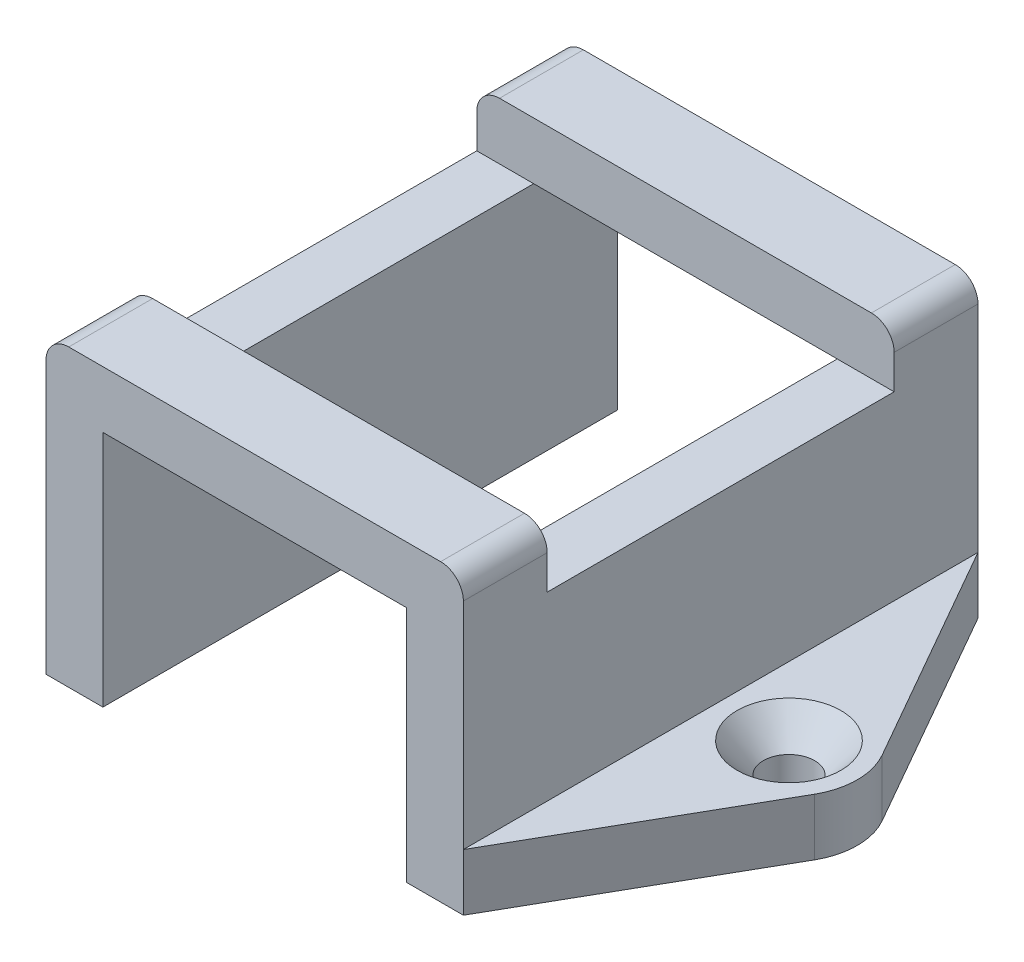
ISO-10303-21;
HEADER;
FILE_DESCRIPTION(('STEP AP214'),'2;1');
FILE_NAME('part.step','',(''),(''),'','','');
FILE_SCHEMA(('AUTOMOTIVE_DESIGN { 1 0 10303 214 1 1 1 1 }'));
ENDSEC;
DATA;
#1=APPLICATION_CONTEXT('core data for automotive mechanical design processes');
#2=APPLICATION_PROTOCOL_DEFINITION('international standard','automotive_design',2000,#1);
#3=PRODUCT_CONTEXT('',#1,'mechanical');
#4=PRODUCT('Part','Part','',(#3));
#5=PRODUCT_RELATED_PRODUCT_CATEGORY('part','',(#4));
#6=PRODUCT_DEFINITION_FORMATION('','',#4);
#7=PRODUCT_DEFINITION_CONTEXT('part definition',#1,'design');
#8=PRODUCT_DEFINITION('design','',#6,#7);
#9=PRODUCT_DEFINITION_SHAPE('','',#8);
#10=(LENGTH_UNIT() NAMED_UNIT(*) SI_UNIT(.MILLI.,.METRE.));
#11=(NAMED_UNIT(*) PLANE_ANGLE_UNIT() SI_UNIT($,.RADIAN.));
#12=(NAMED_UNIT(*) SI_UNIT($,.STERADIAN.) SOLID_ANGLE_UNIT());
#13=UNCERTAINTY_MEASURE_WITH_UNIT(LENGTH_MEASURE(1.E-05),#10,'distance_accuracy_value','');
#14=(GEOMETRIC_REPRESENTATION_CONTEXT(3) GLOBAL_UNCERTAINTY_ASSIGNED_CONTEXT((#13)) GLOBAL_UNIT_ASSIGNED_CONTEXT((#10,
#11,#12)) REPRESENTATION_CONTEXT('',''));
#15=CARTESIAN_POINT('',(0.,0.,0.));
#16=DIRECTION('',(0.,0.,1.));
#17=DIRECTION('',(1.,0.,0.));
#18=AXIS2_PLACEMENT_3D('',#15,#16,#17);
#19=CARTESIAN_POINT('',(13.335,0.,22.606));
#20=DIRECTION('',(0.,1.,0.));
#21=DIRECTION('',(-1.,0.,0.));
#22=AXIS2_PLACEMENT_3D('',#19,#20,#21);
#23=PLANE('',#22);
#24=CARTESIAN_POINT('',(24.335,0.,0.));
#25=DIRECTION('',(0.,1.,0.));
#26=DIRECTION('',(0.,0.,1.));
#27=AXIS2_PLACEMENT_3D('',#24,#25,#26);
#28=CIRCLE('',#27,2.2479);
#29=CARTESIAN_POINT('',(24.335,0.,2.2479));
#30=VERTEX_POINT('',#29);
#31=EDGE_CURVE('E339',#30,#30,#28,.T.);
#32=ORIENTED_EDGE('',*,*,#31,.T.);
#33=EDGE_LOOP('',(#32));
#34=FACE_BOUND('',#33,.T.);
#35=CARTESIAN_POINT('',(24.335,0.,0.));
#36=DIRECTION('',(0.,1.,0.));
#37=DIRECTION('',(-1.,0.,0.));
#38=AXIS2_PLACEMENT_3D('',#35,#36,#37);
#39=CIRCLE('',#38,6.00000000000001);
#40=CARTESIAN_POINT('',(29.5452827561386,0.,2.97539133578837));
#41=VERTEX_POINT('',#40);
#42=CARTESIAN_POINT('',(29.5452827561386,0.,-2.97539133578837));
#43=VERTEX_POINT('',#42);
#44=EDGE_CURVE('E319',#41,#43,#39,.T.);
#45=ORIENTED_EDGE('',*,*,#44,.F.);
#46=DIRECTION('',(0.495898555964728,0.,-0.868380459356438));
#47=VECTOR('',#46,1.);
#48=CARTESIAN_POINT('',(23.5609320371833,0.,13.4547387018373));
#49=LINE('',#48,#47);
#50=CARTESIAN_POINT('',(18.335,0.,22.606));
#51=VERTEX_POINT('',#50);
#52=EDGE_CURVE('E307',#51,#41,#49,.T.);
#53=ORIENTED_EDGE('',*,*,#52,.F.);
#54=DIRECTION('',(1.,0.,0.));
#55=VECTOR('',#54,1.);
#56=CARTESIAN_POINT('',(13.335,0.,22.606));
#57=LINE('',#56,#55);
#58=CARTESIAN_POINT('',(13.335,0.,22.606));
#59=VERTEX_POINT('',#58);
#60=EDGE_CURVE('E366',#59,#51,#57,.T.);
#61=ORIENTED_EDGE('',*,*,#60,.F.);
#62=DIRECTION('',(0.,0.,-1.));
#63=VECTOR('',#62,1.);
#64=CARTESIAN_POINT('',(13.335,0.,22.606));
#65=LINE('',#64,#63);
#66=CARTESIAN_POINT('',(13.335,0.,-22.606));
#67=VERTEX_POINT('',#66);
#68=EDGE_CURVE('E387',#59,#67,#65,.T.);
#69=ORIENTED_EDGE('',*,*,#68,.T.);
#70=DIRECTION('',(1.,0.,0.));
#71=VECTOR('',#70,1.);
#72=CARTESIAN_POINT('',(13.335,0.,-22.606));
#73=LINE('',#72,#71);
#74=CARTESIAN_POINT('',(18.335,0.,-22.606));
#75=VERTEX_POINT('',#74);
#76=EDGE_CURVE('E378',#67,#75,#73,.T.);
#77=ORIENTED_EDGE('',*,*,#76,.T.);
#78=DIRECTION('',(-0.495898555964728,0.,-0.868380459356438));
#79=VECTOR('',#78,1.);
#80=CARTESIAN_POINT('',(23.5609320371833,0.,-13.4547387018373));
#81=LINE('',#80,#79);
#82=EDGE_CURVE('E321',#43,#75,#81,.T.);
#83=ORIENTED_EDGE('',*,*,#82,.F.);
#84=EDGE_LOOP('',(#45,#53,#61,#69,#77,#83));
#85=FACE_BOUND('',#84,.T.);
#86=ADVANCED_FACE('F35',(#34,#85),#23,.F.);
#87=CARTESIAN_POINT('',(30.335,5.,22.606));
#88=DIRECTION('',(0.,-1.,0.));
#89=DIRECTION('',(1.,0.,0.));
#90=AXIS2_PLACEMENT_3D('',#87,#88,#89);
#91=PLANE('',#90);
#92=CARTESIAN_POINT('',(24.335,5.00000000000001,0.));
#93=DIRECTION('',(0.,1.,0.));
#94=DIRECTION('',(0.,0.,1.));
#95=AXIS2_PLACEMENT_3D('',#92,#93,#94);
#96=CIRCLE('',#95,4.5593);
#97=CARTESIAN_POINT('',(24.335,5.00000000000001,4.5593));
#98=VERTEX_POINT('',#97);
#99=EDGE_CURVE('E332',#98,#98,#96,.T.);
#100=ORIENTED_EDGE('',*,*,#99,.F.);
#101=EDGE_LOOP('',(#100));
#102=FACE_BOUND('',#101,.T.);
#103=DIRECTION('',(0.495898555964728,0.,-0.868380459356438));
#104=VECTOR('',#103,1.);
#105=CARTESIAN_POINT('',(23.5609320371833,5.,13.4547387018373));
#106=LINE('',#105,#104);
#107=CARTESIAN_POINT('',(18.335,5.,22.606));
#108=VERTEX_POINT('',#107);
#109=CARTESIAN_POINT('',(29.5452827561386,5.,2.97539133578837));
#110=VERTEX_POINT('',#109);
#111=EDGE_CURVE('E306',#108,#110,#106,.T.);
#112=ORIENTED_EDGE('',*,*,#111,.T.);
#113=CARTESIAN_POINT('',(24.335,5.,0.));
#114=DIRECTION('',(0.,1.,0.));
#115=DIRECTION('',(-1.,0.,0.));
#116=AXIS2_PLACEMENT_3D('',#113,#114,#115);
#117=CIRCLE('',#116,6.00000000000001);
#118=CARTESIAN_POINT('',(29.5452827561386,5.,-2.97539133578837));
#119=VERTEX_POINT('',#118);
#120=EDGE_CURVE('E316',#110,#119,#117,.T.);
#121=ORIENTED_EDGE('',*,*,#120,.T.);
#122=DIRECTION('',(-0.495898555964728,0.,-0.868380459356438));
#123=VECTOR('',#122,1.);
#124=CARTESIAN_POINT('',(23.5609320371833,5.,-13.4547387018373));
#125=LINE('',#124,#123);
#126=CARTESIAN_POINT('',(18.335,5.,-22.606));
#127=VERTEX_POINT('',#126);
#128=EDGE_CURVE('E322',#119,#127,#125,.T.);
#129=ORIENTED_EDGE('',*,*,#128,.T.);
#130=DIRECTION('',(0.,0.,-1.));
#131=VECTOR('',#130,1.);
#132=CARTESIAN_POINT('',(18.335,5.,22.606));
#133=LINE('',#132,#131);
#134=EDGE_CURVE('E373',#108,#127,#133,.T.);
#135=ORIENTED_EDGE('',*,*,#134,.F.);
#136=EDGE_LOOP('',(#112,#121,#129,#135));
#137=FACE_BOUND('',#136,.T.);
#138=ADVANCED_FACE('F466',(#102,#137),#91,.F.);
#139=CARTESIAN_POINT('',(0.,0.,22.606));
#140=DIRECTION('',(0.,0.,1.));
#141=DIRECTION('',(1.,0.,0.));
#142=AXIS2_PLACEMENT_3D('',#139,#140,#141);
#143=PLANE('',#142);
#144=DIRECTION('',(0.,1.,0.));
#145=VECTOR('',#144,1.);
#146=CARTESIAN_POINT('',(18.335,5.,22.606));
#147=LINE('',#146,#145);
#148=CARTESIAN_POINT('',(18.335,23.9042,22.606));
#149=VERTEX_POINT('',#148);
#150=EDGE_CURVE('E369',#108,#149,#147,.T.);
#151=ORIENTED_EDGE('',*,*,#150,.T.);
#152=CARTESIAN_POINT('',(16.335,23.9042,22.606));
#153=DIRECTION('',(0.,0.,1.));
#154=DIRECTION('',(1.,0.,0.));
#155=AXIS2_PLACEMENT_3D('',#152,#153,#154);
#156=CIRCLE('',#155,2.);
#157=CARTESIAN_POINT('',(16.335,25.9042,22.606));
#158=VERTEX_POINT('',#157);
#159=EDGE_CURVE('E11',#149,#158,#156,.T.);
#160=ORIENTED_EDGE('',*,*,#159,.T.);
#161=DIRECTION('',(-1.,0.,0.));
#162=VECTOR('',#161,1.);
#163=CARTESIAN_POINT('',(18.335,25.9042,22.606));
#164=LINE('',#163,#162);
#165=CARTESIAN_POINT('',(-16.335,25.9042,22.606));
#166=VERTEX_POINT('',#165);
#167=EDGE_CURVE('E371',#158,#166,#164,.T.);
#168=ORIENTED_EDGE('',*,*,#167,.T.);
#169=CARTESIAN_POINT('',(-16.335,23.9042,22.606));
#170=DIRECTION('',(0.,0.,-1.));
#171=DIRECTION('',(-1.,0.,0.));
#172=AXIS2_PLACEMENT_3D('',#169,#170,#171);
#173=CIRCLE('',#172,2.);
#174=CARTESIAN_POINT('',(-18.335,23.9042,22.606));
#175=VERTEX_POINT('',#174);
#176=EDGE_CURVE('E303',#175,#166,#173,.T.);
#177=ORIENTED_EDGE('',*,*,#176,.F.);
#178=DIRECTION('',(0.,1.,0.));
#179=VECTOR('',#178,1.);
#180=CARTESIAN_POINT('',(-18.335,5.,22.606));
#181=LINE('',#180,#179);
#182=CARTESIAN_POINT('',(-18.335,5.,22.606));
#183=VERTEX_POINT('',#182);
#184=EDGE_CURVE('E262',#183,#175,#181,.T.);
#185=ORIENTED_EDGE('',*,*,#184,.F.);
#186=DIRECTION('',(0.,1.,0.));
#187=VECTOR('',#186,1.);
#188=CARTESIAN_POINT('',(-18.335,0.,22.606));
#189=LINE('',#188,#187);
#190=CARTESIAN_POINT('',(-18.335,0.,22.606));
#191=VERTEX_POINT('',#190);
#192=EDGE_CURVE('E206',#191,#183,#189,.T.);
#193=ORIENTED_EDGE('',*,*,#192,.F.);
#194=DIRECTION('',(-1.,0.,0.));
#195=VECTOR('',#194,1.);
#196=CARTESIAN_POINT('',(-13.335,0.,22.606));
#197=LINE('',#196,#195);
#198=CARTESIAN_POINT('',(-13.335,0.,22.606));
#199=VERTEX_POINT('',#198);
#200=EDGE_CURVE('E215',#199,#191,#197,.T.);
#201=ORIENTED_EDGE('',*,*,#200,.F.);
#202=DIRECTION('',(0.,-1.,0.));
#203=VECTOR('',#202,1.);
#204=CARTESIAN_POINT('',(-13.335,20.9042,22.606));
#205=LINE('',#204,#203);
#206=CARTESIAN_POINT('',(-13.335,20.9042,22.606));
#207=VERTEX_POINT('',#206);
#208=EDGE_CURVE('E258',#207,#199,#205,.T.);
#209=ORIENTED_EDGE('',*,*,#208,.F.);
#210=DIRECTION('',(1.,0.,0.));
#211=VECTOR('',#210,1.);
#212=CARTESIAN_POINT('',(0.,20.9042,22.606));
#213=LINE('',#212,#211);
#214=CARTESIAN_POINT('',(13.335,20.9042,22.606));
#215=VERTEX_POINT('',#214);
#216=EDGE_CURVE('E361',#207,#215,#213,.T.);
#217=ORIENTED_EDGE('',*,*,#216,.T.);
#218=DIRECTION('',(0.,-1.,0.));
#219=VECTOR('',#218,1.);
#220=CARTESIAN_POINT('',(13.335,20.9042,22.606));
#221=LINE('',#220,#219);
#222=EDGE_CURVE('E363',#215,#59,#221,.T.);
#223=ORIENTED_EDGE('',*,*,#222,.T.);
#224=ORIENTED_EDGE('',*,*,#60,.T.);
#225=DIRECTION('',(0.,1.,0.));
#226=VECTOR('',#225,1.);
#227=CARTESIAN_POINT('',(18.335,0.,22.606));
#228=LINE('',#227,#226);
#229=EDGE_CURVE('E313',#51,#108,#228,.T.);
#230=ORIENTED_EDGE('',*,*,#229,.T.);
#231=EDGE_LOOP('',(#151,#160,#168,#177,#185,#193,#201,#209,#217,#223,#224,#230));
#232=FACE_BOUND('',#231,.T.);
#233=ADVANCED_FACE('F425',(#232),#143,.T.);
#234=CARTESIAN_POINT('',(0.,0.,-22.606));
#235=DIRECTION('',(0.,0.,1.));
#236=DIRECTION('',(1.,0.,0.));
#237=AXIS2_PLACEMENT_3D('',#234,#235,#236);
#238=PLANE('',#237);
#239=DIRECTION('',(-1.,0.,0.));
#240=VECTOR('',#239,1.);
#241=CARTESIAN_POINT('',(18.335,25.9042,-22.606));
#242=LINE('',#241,#240);
#243=CARTESIAN_POINT('',(16.335,25.9042,-22.606));
#244=VERTEX_POINT('',#243);
#245=CARTESIAN_POINT('',(-16.335,25.9042,-22.606));
#246=VERTEX_POINT('',#245);
#247=EDGE_CURVE('E364',#244,#246,#242,.T.);
#248=ORIENTED_EDGE('',*,*,#247,.F.);
#249=CARTESIAN_POINT('',(16.335,23.9042,-22.606));
#250=DIRECTION('',(0.,0.,1.));
#251=DIRECTION('',(1.,0.,0.));
#252=AXIS2_PLACEMENT_3D('',#249,#250,#251);
#253=CIRCLE('',#252,2.);
#254=CARTESIAN_POINT('',(18.335,23.9042,-22.606));
#255=VERTEX_POINT('',#254);
#256=EDGE_CURVE('E402',#244,#255,#253,.F.);
#257=ORIENTED_EDGE('',*,*,#256,.T.);
#258=DIRECTION('',(0.,1.,0.));
#259=VECTOR('',#258,1.);
#260=CARTESIAN_POINT('',(18.335,5.,-22.606));
#261=LINE('',#260,#259);
#262=EDGE_CURVE('E381',#127,#255,#261,.T.);
#263=ORIENTED_EDGE('',*,*,#262,.F.);
#264=DIRECTION('',(0.,1.,0.));
#265=VECTOR('',#264,1.);
#266=CARTESIAN_POINT('',(18.335,0.,-22.606));
#267=LINE('',#266,#265);
#268=EDGE_CURVE('E324',#75,#127,#267,.T.);
#269=ORIENTED_EDGE('',*,*,#268,.F.);
#270=ORIENTED_EDGE('',*,*,#76,.F.);
#271=DIRECTION('',(0.,-1.,0.));
#272=VECTOR('',#271,1.);
#273=CARTESIAN_POINT('',(13.335,20.9042,-22.606));
#274=LINE('',#273,#272);
#275=CARTESIAN_POINT('',(13.335,20.9042,-22.606));
#276=VERTEX_POINT('',#275);
#277=EDGE_CURVE('E376',#276,#67,#274,.T.);
#278=ORIENTED_EDGE('',*,*,#277,.F.);
#279=DIRECTION('',(1.,0.,0.));
#280=VECTOR('',#279,1.);
#281=CARTESIAN_POINT('',(0.,20.9042,-22.606));
#282=LINE('',#281,#280);
#283=CARTESIAN_POINT('',(-13.335,20.9042,-22.606));
#284=VERTEX_POINT('',#283);
#285=EDGE_CURVE('E360',#284,#276,#282,.T.);
#286=ORIENTED_EDGE('',*,*,#285,.F.);
#287=DIRECTION('',(0.,-1.,0.));
#288=VECTOR('',#287,1.);
#289=CARTESIAN_POINT('',(-13.335,20.9042,-22.606));
#290=LINE('',#289,#288);
#291=CARTESIAN_POINT('',(-13.335,0.,-22.606));
#292=VERTEX_POINT('',#291);
#293=EDGE_CURVE('E257',#284,#292,#290,.T.);
#294=ORIENTED_EDGE('',*,*,#293,.T.);
#295=DIRECTION('',(-1.,0.,0.));
#296=VECTOR('',#295,1.);
#297=CARTESIAN_POINT('',(-13.335,0.,-22.606));
#298=LINE('',#297,#296);
#299=CARTESIAN_POINT('',(-18.335,0.,-22.606));
#300=VERTEX_POINT('',#299);
#301=EDGE_CURVE('E267',#292,#300,#298,.T.);
#302=ORIENTED_EDGE('',*,*,#301,.T.);
#303=DIRECTION('',(0.,1.,0.));
#304=VECTOR('',#303,1.);
#305=CARTESIAN_POINT('',(-18.335,0.,-22.606));
#306=LINE('',#305,#304);
#307=CARTESIAN_POINT('',(-18.335,5.,-22.606));
#308=VERTEX_POINT('',#307);
#309=EDGE_CURVE('E223',#300,#308,#306,.T.);
#310=ORIENTED_EDGE('',*,*,#309,.T.);
#311=DIRECTION('',(0.,1.,0.));
#312=VECTOR('',#311,1.);
#313=CARTESIAN_POINT('',(-18.335,5.,-22.606));
#314=LINE('',#313,#312);
#315=CARTESIAN_POINT('',(-18.335,23.9042,-22.606));
#316=VERTEX_POINT('',#315);
#317=EDGE_CURVE('E260',#308,#316,#314,.T.);
#318=ORIENTED_EDGE('',*,*,#317,.T.);
#319=CARTESIAN_POINT('',(-16.335,23.9042,-22.606));
#320=DIRECTION('',(0.,0.,-1.));
#321=DIRECTION('',(-1.,0.,0.));
#322=AXIS2_PLACEMENT_3D('',#319,#320,#321);
#323=CIRCLE('',#322,2.);
#324=EDGE_CURVE('E287',#246,#316,#323,.F.);
#325=ORIENTED_EDGE('',*,*,#324,.F.);
#326=EDGE_LOOP('',(#248,#257,#263,#269,#270,#278,#286,#294,#302,#310,#318,#325));
#327=FACE_BOUND('',#326,.T.);
#328=ADVANCED_FACE('F473',(#327),#238,.F.);
#329=CARTESIAN_POINT('',(0.,20.9042,22.606));
#330=DIRECTION('',(0.,1.,0.));
#331=DIRECTION('',(0.,0.,1.));
#332=AXIS2_PLACEMENT_3D('',#329,#330,#331);
#333=PLANE('',#332);
#334=ORIENTED_EDGE('',*,*,#216,.F.);
#335=DIRECTION('',(0.,0.,-1.));
#336=VECTOR('',#335,1.);
#337=CARTESIAN_POINT('',(-13.335,20.9042,22.606));
#338=LINE('',#337,#336);
#339=CARTESIAN_POINT('',(-13.335,20.9042,15.24));
#340=VERTEX_POINT('',#339);
#341=EDGE_CURVE('E278',#207,#340,#338,.T.);
#342=ORIENTED_EDGE('',*,*,#341,.T.);
#343=DIRECTION('',(-1.,0.,0.));
#344=VECTOR('',#343,1.);
#345=CARTESIAN_POINT('',(0.,20.9042,15.24));
#346=LINE('',#345,#344);
#347=CARTESIAN_POINT('',(13.335,20.9042,15.24));
#348=VERTEX_POINT('',#347);
#349=EDGE_CURVE('E351',#348,#340,#346,.T.);
#350=ORIENTED_EDGE('',*,*,#349,.F.);
#351=DIRECTION('',(0.,0.,-1.));
#352=VECTOR('',#351,1.);
#353=CARTESIAN_POINT('',(13.335,20.9042,22.606));
#354=LINE('',#353,#352);
#355=EDGE_CURVE('E391',#215,#348,#354,.T.);
#356=ORIENTED_EDGE('',*,*,#355,.F.);
#357=EDGE_LOOP('',(#334,#342,#350,#356));
#358=FACE_BOUND('',#357,.T.);
#359=ADVANCED_FACE('F447',(#358),#333,.F.);
#360=CARTESIAN_POINT('',(18.335,25.9042,22.606));
#361=DIRECTION('',(0.,-1.,0.));
#362=DIRECTION('',(1.,0.,0.));
#363=AXIS2_PLACEMENT_3D('',#360,#361,#362);
#364=PLANE('',#363);
#365=ORIENTED_EDGE('',*,*,#167,.F.);
#366=DIRECTION('',(0.,0.,-1.));
#367=VECTOR('',#366,1.);
#368=CARTESIAN_POINT('',(16.335,25.9042,22.606));
#369=LINE('',#368,#367);
#370=CARTESIAN_POINT('',(16.335,25.9042,15.24));
#371=VERTEX_POINT('',#370);
#372=EDGE_CURVE('E410',#158,#371,#369,.T.);
#373=ORIENTED_EDGE('',*,*,#372,.T.);
#374=DIRECTION('',(-1.,0.,0.));
#375=VECTOR('',#374,1.);
#376=CARTESIAN_POINT('',(18.335,25.9042,15.24));
#377=LINE('',#376,#375);
#378=CARTESIAN_POINT('',(-16.335,25.9042,15.24));
#379=VERTEX_POINT('',#378);
#380=EDGE_CURVE('E394',#371,#379,#377,.T.);
#381=ORIENTED_EDGE('',*,*,#380,.T.);
#382=DIRECTION('',(0.,0.,-1.));
#383=VECTOR('',#382,1.);
#384=CARTESIAN_POINT('',(-16.335,25.9042,22.606));
#385=LINE('',#384,#383);
#386=EDGE_CURVE('E298',#166,#379,#385,.T.);
#387=ORIENTED_EDGE('',*,*,#386,.F.);
#388=EDGE_LOOP('',(#365,#373,#381,#387));
#389=FACE_BOUND('',#388,.T.);
#390=ADVANCED_FACE('F422',(#389),#364,.F.);
#391=CARTESIAN_POINT('',(13.335,20.9042,-15.24));
#392=VERTEX_POINT('',#391);
#393=EDGE_CURVE('E390',#392,#276,#354,.T.);
#394=ORIENTED_EDGE('',*,*,#393,.F.);
#395=DIRECTION('',(1.,0.,0.));
#396=VECTOR('',#395,1.);
#397=CARTESIAN_POINT('',(0.,20.9042,-15.24));
#398=LINE('',#397,#396);
#399=CARTESIAN_POINT('',(-13.335,20.9042,-15.24));
#400=VERTEX_POINT('',#399);
#401=EDGE_CURVE('E348',#400,#392,#398,.T.);
#402=ORIENTED_EDGE('',*,*,#401,.F.);
#403=EDGE_CURVE('E277',#400,#284,#338,.T.);
#404=ORIENTED_EDGE('',*,*,#403,.T.);
#405=ORIENTED_EDGE('',*,*,#285,.T.);
#406=EDGE_LOOP('',(#394,#402,#404,#405));
#407=FACE_BOUND('',#406,.T.);
#408=ADVANCED_FACE('F496',(#407),#333,.F.);
#409=CARTESIAN_POINT('',(13.335,20.9042,22.606));
#410=DIRECTION('',(1.,0.,0.));
#411=DIRECTION('',(0.,0.,-1.));
#412=AXIS2_PLACEMENT_3D('',#409,#410,#411);
#413=PLANE('',#412);
#414=ORIENTED_EDGE('',*,*,#277,.T.);
#415=ORIENTED_EDGE('',*,*,#68,.F.);
#416=ORIENTED_EDGE('',*,*,#222,.F.);
#417=ORIENTED_EDGE('',*,*,#355,.T.);
#418=DIRECTION('',(0.,0.,-1.));
#419=VECTOR('',#418,1.);
#420=CARTESIAN_POINT('',(13.335,20.9042,22.606));
#421=LINE('',#420,#419);
#422=EDGE_CURVE('E357',#348,#392,#421,.T.);
#423=ORIENTED_EDGE('',*,*,#422,.T.);
#424=ORIENTED_EDGE('',*,*,#393,.T.);
#425=EDGE_LOOP('',(#414,#415,#416,#417,#423,#424));
#426=FACE_BOUND('',#425,.T.);
#427=ADVANCED_FACE('F453',(#426),#413,.F.);
#428=CARTESIAN_POINT('',(18.335,5.,22.606));
#429=DIRECTION('',(-1.,0.,0.));
#430=DIRECTION('',(0.,0.,1.));
#431=AXIS2_PLACEMENT_3D('',#428,#429,#430);
#432=PLANE('',#431);
#433=ORIENTED_EDGE('',*,*,#262,.T.);
#434=DIRECTION('',(0.,0.,-1.));
#435=VECTOR('',#434,1.);
#436=CARTESIAN_POINT('',(18.335,23.9042,22.606));
#437=LINE('',#436,#435);
#438=CARTESIAN_POINT('',(18.335,23.9042,-15.24));
#439=VERTEX_POINT('',#438);
#440=EDGE_CURVE('E406',#255,#439,#437,.F.);
#441=ORIENTED_EDGE('',*,*,#440,.T.);
#442=DIRECTION('',(0.,-1.,0.));
#443=VECTOR('',#442,1.);
#444=CARTESIAN_POINT('',(18.335,5.,-15.24));
#445=LINE('',#444,#443);
#446=CARTESIAN_POINT('',(18.335,20.9042,-15.24));
#447=VERTEX_POINT('',#446);
#448=EDGE_CURVE('E346',#439,#447,#445,.T.);
#449=ORIENTED_EDGE('',*,*,#448,.T.);
#450=DIRECTION('',(0.,0.,1.));
#451=VECTOR('',#450,1.);
#452=CARTESIAN_POINT('',(18.335,20.9042,22.606));
#453=LINE('',#452,#451);
#454=CARTESIAN_POINT('',(18.335,20.9042,15.24));
#455=VERTEX_POINT('',#454);
#456=EDGE_CURVE('E396',#447,#455,#453,.T.);
#457=ORIENTED_EDGE('',*,*,#456,.T.);
#458=DIRECTION('',(0.,1.,0.));
#459=VECTOR('',#458,1.);
#460=CARTESIAN_POINT('',(18.335,5.,15.24));
#461=LINE('',#460,#459);
#462=CARTESIAN_POINT('',(18.335,23.9042,15.24));
#463=VERTEX_POINT('',#462);
#464=EDGE_CURVE('E354',#455,#463,#461,.T.);
#465=ORIENTED_EDGE('',*,*,#464,.T.);
#466=DIRECTION('',(0.,0.,-1.));
#467=VECTOR('',#466,1.);
#468=CARTESIAN_POINT('',(18.335,23.9042,22.606));
#469=LINE('',#468,#467);
#470=EDGE_CURVE('E404',#463,#149,#469,.F.);
#471=ORIENTED_EDGE('',*,*,#470,.T.);
#472=ORIENTED_EDGE('',*,*,#150,.F.);
#473=ORIENTED_EDGE('',*,*,#134,.T.);
#474=EDGE_LOOP('',(#433,#441,#449,#457,#465,#471,#472,#473));
#475=FACE_BOUND('',#474,.T.);
#476=ADVANCED_FACE('F418',(#475),#432,.F.);
#477=DIRECTION('',(1.,0.,0.));
#478=VECTOR('',#477,1.);
#479=CARTESIAN_POINT('',(0.,25.9042,-15.24));
#480=LINE('',#479,#478);
#481=CARTESIAN_POINT('',(-16.335,25.9042,-15.24));
#482=VERTEX_POINT('',#481);
#483=CARTESIAN_POINT('',(16.335,25.9042,-15.24));
#484=VERTEX_POINT('',#483);
#485=EDGE_CURVE('E343',#482,#484,#480,.T.);
#486=ORIENTED_EDGE('',*,*,#485,.T.);
#487=DIRECTION('',(0.,0.,-1.));
#488=VECTOR('',#487,1.);
#489=CARTESIAN_POINT('',(16.335,25.9042,22.606));
#490=LINE('',#489,#488);
#491=EDGE_CURVE('E399',#484,#244,#490,.T.);
#492=ORIENTED_EDGE('',*,*,#491,.T.);
#493=ORIENTED_EDGE('',*,*,#247,.T.);
#494=DIRECTION('',(0.,0.,-1.));
#495=VECTOR('',#494,1.);
#496=CARTESIAN_POINT('',(-16.335,25.9042,22.606));
#497=LINE('',#496,#495);
#498=EDGE_CURVE('E284',#482,#246,#497,.T.);
#499=ORIENTED_EDGE('',*,*,#498,.F.);
#500=EDGE_LOOP('',(#486,#492,#493,#499));
#501=FACE_BOUND('',#500,.T.);
#502=ADVANCED_FACE('F480',(#501),#364,.F.);
#503=CARTESIAN_POINT('',(0.,20.9042,0.));
#504=DIRECTION('',(0.,-1.,0.));
#505=DIRECTION('',(0.,0.,-1.));
#506=AXIS2_PLACEMENT_3D('',#503,#504,#505);
#507=PLANE('',#506);
#508=EDGE_CURVE('E347',#455,#348,#346,.T.);
#509=ORIENTED_EDGE('',*,*,#508,.F.);
#510=ORIENTED_EDGE('',*,*,#456,.F.);
#511=EDGE_CURVE('E342',#392,#447,#398,.T.);
#512=ORIENTED_EDGE('',*,*,#511,.F.);
#513=ORIENTED_EDGE('',*,*,#422,.F.);
#514=EDGE_LOOP('',(#509,#510,#512,#513));
#515=FACE_BOUND('',#514,.T.);
#516=ADVANCED_FACE('F498',(#515),#507,.F.);
#517=CARTESIAN_POINT('',(0.,25.9042,15.24));
#518=DIRECTION('',(0.,0.,1.));
#519=DIRECTION('',(1.,0.,0.));
#520=AXIS2_PLACEMENT_3D('',#517,#518,#519);
#521=PLANE('',#520);
#522=ORIENTED_EDGE('',*,*,#380,.F.);
#523=CARTESIAN_POINT('',(16.335,23.9042,15.24));
#524=DIRECTION('',(0.,0.,1.));
#525=DIRECTION('',(1.,0.,0.));
#526=AXIS2_PLACEMENT_3D('',#523,#524,#525);
#527=CIRCLE('',#526,2.);
#528=EDGE_CURVE('E43',#371,#463,#527,.F.);
#529=ORIENTED_EDGE('',*,*,#528,.T.);
#530=ORIENTED_EDGE('',*,*,#464,.F.);
#531=ORIENTED_EDGE('',*,*,#508,.T.);
#532=ORIENTED_EDGE('',*,*,#349,.T.);
#533=DIRECTION('',(1.,0.,0.));
#534=VECTOR('',#533,1.);
#535=CARTESIAN_POINT('',(0.,20.9042,15.24));
#536=LINE('',#535,#534);
#537=CARTESIAN_POINT('',(-18.335,20.9042,15.24));
#538=VERTEX_POINT('',#537);
#539=EDGE_CURVE('E245',#538,#340,#536,.T.);
#540=ORIENTED_EDGE('',*,*,#539,.F.);
#541=DIRECTION('',(0.,1.,0.));
#542=VECTOR('',#541,1.);
#543=CARTESIAN_POINT('',(-18.335,5.,15.24));
#544=LINE('',#543,#542);
#545=CARTESIAN_POINT('',(-18.335,23.9042,15.24));
#546=VERTEX_POINT('',#545);
#547=EDGE_CURVE('E251',#538,#546,#544,.T.);
#548=ORIENTED_EDGE('',*,*,#547,.T.);
#549=CARTESIAN_POINT('',(-16.335,23.9042,15.24));
#550=DIRECTION('',(0.,0.,-1.));
#551=DIRECTION('',(-1.,0.,0.));
#552=AXIS2_PLACEMENT_3D('',#549,#550,#551);
#553=CIRCLE('',#552,2.);
#554=EDGE_CURVE('E301',#379,#546,#553,.F.);
#555=ORIENTED_EDGE('',*,*,#554,.F.);
#556=EDGE_LOOP('',(#522,#529,#530,#531,#532,#540,#548,#555));
#557=FACE_BOUND('',#556,.T.);
#558=ADVANCED_FACE('F413',(#557),#521,.F.);
#559=CARTESIAN_POINT('',(0.,25.9042,-15.24));
#560=DIRECTION('',(0.,0.,-1.));
#561=DIRECTION('',(-1.,0.,0.));
#562=AXIS2_PLACEMENT_3D('',#559,#560,#561);
#563=PLANE('',#562);
#564=ORIENTED_EDGE('',*,*,#448,.F.);
#565=CARTESIAN_POINT('',(16.335,23.9042,-15.24));
#566=DIRECTION('',(0.,0.,-1.));
#567=DIRECTION('',(-1.,0.,0.));
#568=AXIS2_PLACEMENT_3D('',#565,#566,#567);
#569=CIRCLE('',#568,2.);
#570=EDGE_CURVE('E408',#439,#484,#569,.F.);
#571=ORIENTED_EDGE('',*,*,#570,.T.);
#572=ORIENTED_EDGE('',*,*,#485,.F.);
#573=CARTESIAN_POINT('',(-16.335,23.9042,-15.24));
#574=DIRECTION('',(0.,0.,1.));
#575=DIRECTION('',(1.,0.,0.));
#576=AXIS2_PLACEMENT_3D('',#573,#574,#575);
#577=CIRCLE('',#576,2.);
#578=CARTESIAN_POINT('',(-18.335,23.9042,-15.24));
#579=VERTEX_POINT('',#578);
#580=EDGE_CURVE('E295',#579,#482,#577,.F.);
#581=ORIENTED_EDGE('',*,*,#580,.F.);
#582=DIRECTION('',(0.,-1.,0.));
#583=VECTOR('',#582,1.);
#584=CARTESIAN_POINT('',(-18.335,5.,-15.24));
#585=LINE('',#584,#583);
#586=CARTESIAN_POINT('',(-18.335,20.9042,-15.24));
#587=VERTEX_POINT('',#586);
#588=EDGE_CURVE('E248',#579,#587,#585,.T.);
#589=ORIENTED_EDGE('',*,*,#588,.T.);
#590=DIRECTION('',(-1.,0.,0.));
#591=VECTOR('',#590,1.);
#592=CARTESIAN_POINT('',(0.,20.9042,-15.24));
#593=LINE('',#592,#591);
#594=EDGE_CURVE('E243',#400,#587,#593,.T.);
#595=ORIENTED_EDGE('',*,*,#594,.F.);
#596=ORIENTED_EDGE('',*,*,#401,.T.);
#597=ORIENTED_EDGE('',*,*,#511,.T.);
#598=EDGE_LOOP('',(#564,#571,#572,#581,#589,#595,#596,#597));
#599=FACE_BOUND('',#598,.T.);
#600=ADVANCED_FACE('F484',(#599),#563,.F.);
#601=CARTESIAN_POINT('',(24.335,5.00000000000001,0.));
#602=DIRECTION('',(0.,1.,0.));
#603=DIRECTION('',(0.,0.,1.));
#604=AXIS2_PLACEMENT_3D('',#601,#602,#603);
#605=CYLINDRICAL_SURFACE('',#604,2.2479);
#606=ORIENTED_EDGE('',*,*,#31,.F.);
#607=EDGE_LOOP('',(#606));
#608=FACE_BOUND('',#607,.T.);
#609=CARTESIAN_POINT('',(24.335,2.34103846354936,0.));
#610=DIRECTION('',(0.,1.,0.));
#611=DIRECTION('',(0.,0.,1.));
#612=AXIS2_PLACEMENT_3D('',#609,#610,#611);
#613=CIRCLE('',#612,2.2479);
#614=CARTESIAN_POINT('',(24.335,2.34103846354936,2.2479));
#615=VERTEX_POINT('',#614);
#616=EDGE_CURVE('E336',#615,#615,#613,.T.);
#617=ORIENTED_EDGE('',*,*,#616,.T.);
#618=EDGE_LOOP('',(#617));
#619=FACE_BOUND('',#618,.T.);
#620=ADVANCED_FACE('F537',(#608,#619),#605,.F.);
#621=CARTESIAN_POINT('',(24.335,5.00000000000001,0.));
#622=DIRECTION('',(0.,1.,0.));
#623=DIRECTION('',(0.,0.,1.));
#624=AXIS2_PLACEMENT_3D('',#621,#622,#623);
#625=CONICAL_SURFACE('',#624,4.5593,0.715584993317676);
#626=ORIENTED_EDGE('',*,*,#616,.F.);
#627=EDGE_LOOP('',(#626));
#628=FACE_BOUND('',#627,.T.);
#629=ORIENTED_EDGE('',*,*,#99,.T.);
#630=EDGE_LOOP('',(#629));
#631=FACE_BOUND('',#630,.T.);
#632=ADVANCED_FACE('F534',(#628,#631),#625,.F.);
#633=CARTESIAN_POINT('',(24.335,0.,0.));
#634=DIRECTION('',(0.,1.,0.));
#635=DIRECTION('',(-1.,0.,0.));
#636=AXIS2_PLACEMENT_3D('',#633,#634,#635);
#637=CYLINDRICAL_SURFACE('',#636,6.00000000000001);
#638=ORIENTED_EDGE('',*,*,#120,.F.);
#639=DIRECTION('',(0.,1.,0.));
#640=VECTOR('',#639,1.);
#641=CARTESIAN_POINT('',(29.5452827561386,0.,2.97539133578837));
#642=LINE('',#641,#640);
#643=EDGE_CURVE('E310',#41,#110,#642,.T.);
#644=ORIENTED_EDGE('',*,*,#643,.F.);
#645=ORIENTED_EDGE('',*,*,#44,.T.);
#646=DIRECTION('',(0.,1.,0.));
#647=VECTOR('',#646,1.);
#648=CARTESIAN_POINT('',(29.5452827561386,0.,-2.97539133578837));
#649=LINE('',#648,#647);
#650=EDGE_CURVE('E329',#43,#119,#649,.T.);
#651=ORIENTED_EDGE('',*,*,#650,.T.);
#652=EDGE_LOOP('',(#638,#644,#645,#651));
#653=FACE_BOUND('',#652,.T.);
#654=ADVANCED_FACE('F463',(#653),#637,.T.);
#655=CARTESIAN_POINT('',(23.5609320371833,0.,-13.4547387018373));
#656=DIRECTION('',(0.868380459356438,0.,-0.495898555964727));
#657=DIRECTION('',(-0.495898555964728,0.,-0.868380459356438));
#658=AXIS2_PLACEMENT_3D('',#655,#656,#657);
#659=PLANE('',#658);
#660=ORIENTED_EDGE('',*,*,#128,.F.);
#661=ORIENTED_EDGE('',*,*,#650,.F.);
#662=ORIENTED_EDGE('',*,*,#82,.T.);
#663=ORIENTED_EDGE('',*,*,#268,.T.);
#664=EDGE_LOOP('',(#660,#661,#662,#663));
#665=FACE_BOUND('',#664,.T.);
#666=ADVANCED_FACE('F525',(#665),#659,.T.);
#667=CARTESIAN_POINT('',(23.5609320371833,0.,13.4547387018373));
#668=DIRECTION('',(0.868380459356438,0.,0.495898555964728));
#669=DIRECTION('',(0.495898555964728,0.,-0.868380459356438));
#670=AXIS2_PLACEMENT_3D('',#667,#668,#669);
#671=PLANE('',#670);
#672=ORIENTED_EDGE('',*,*,#111,.F.);
#673=ORIENTED_EDGE('',*,*,#229,.F.);
#674=ORIENTED_EDGE('',*,*,#52,.T.);
#675=ORIENTED_EDGE('',*,*,#643,.T.);
#676=EDGE_LOOP('',(#672,#673,#674,#675));
#677=FACE_BOUND('',#676,.T.);
#678=ADVANCED_FACE('F461',(#677),#671,.T.);
#679=CARTESIAN_POINT('',(16.335,23.9042,22.606));
#680=DIRECTION('',(0.,0.,-1.));
#681=DIRECTION('',(-1.,0.,0.));
#682=AXIS2_PLACEMENT_3D('',#679,#680,#681);
#683=CYLINDRICAL_SURFACE('',#682,2.);
#684=ORIENTED_EDGE('',*,*,#570,.F.);
#685=ORIENTED_EDGE('',*,*,#440,.F.);
#686=ORIENTED_EDGE('',*,*,#256,.F.);
#687=ORIENTED_EDGE('',*,*,#491,.F.);
#688=EDGE_LOOP('',(#684,#685,#686,#687));
#689=FACE_BOUND('',#688,.T.);
#690=ADVANCED_FACE('F478',(#689),#683,.T.);
#691=CARTESIAN_POINT('',(16.335,23.9042,22.606));
#692=DIRECTION('',(0.,0.,-1.));
#693=DIRECTION('',(-1.,0.,0.));
#694=AXIS2_PLACEMENT_3D('',#691,#692,#693);
#695=CYLINDRICAL_SURFACE('',#694,2.);
#696=ORIENTED_EDGE('',*,*,#159,.F.);
#697=ORIENTED_EDGE('',*,*,#470,.F.);
#698=ORIENTED_EDGE('',*,*,#528,.F.);
#699=ORIENTED_EDGE('',*,*,#372,.F.);
#700=EDGE_LOOP('',(#696,#697,#698,#699));
#701=FACE_BOUND('',#700,.T.);
#702=ADVANCED_FACE('F37',(#701),#695,.T.);
#703=CARTESIAN_POINT('',(-13.335,0.,22.606));
#704=DIRECTION('',(0.,1.,0.));
#705=DIRECTION('',(1.,0.,0.));
#706=AXIS2_PLACEMENT_3D('',#703,#704,#705);
#707=PLANE('',#706);
#708=CARTESIAN_POINT('',(-24.335,0.,0.));
#709=DIRECTION('',(0.,-1.,0.));
#710=DIRECTION('',(0.,0.,1.));
#711=AXIS2_PLACEMENT_3D('',#708,#709,#710);
#712=CIRCLE('',#711,2.2479);
#713=CARTESIAN_POINT('',(-24.335,0.,2.2479));
#714=VERTEX_POINT('',#713);
#715=EDGE_CURVE('E240',#714,#714,#712,.T.);
#716=ORIENTED_EDGE('',*,*,#715,.F.);
#717=EDGE_LOOP('',(#716));
#718=FACE_BOUND('',#717,.T.);
#719=CARTESIAN_POINT('',(-24.335,0.,0.));
#720=DIRECTION('',(0.,-1.,0.));
#721=DIRECTION('',(1.,0.,0.));
#722=AXIS2_PLACEMENT_3D('',#719,#720,#721);
#723=CIRCLE('',#722,6.00000000000001);
#724=CARTESIAN_POINT('',(-29.5452827561386,0.,2.97539133578837));
#725=VERTEX_POINT('',#724);
#726=CARTESIAN_POINT('',(-29.5452827561386,0.,-2.97539133578837));
#727=VERTEX_POINT('',#726);
#728=EDGE_CURVE('E212',#725,#727,#723,.T.);
#729=ORIENTED_EDGE('',*,*,#728,.T.);
#730=DIRECTION('',(0.495898555964728,0.,-0.868380459356438));
#731=VECTOR('',#730,1.);
#732=CARTESIAN_POINT('',(-23.5609320371833,0.,-13.4547387018373));
#733=LINE('',#732,#731);
#734=EDGE_CURVE('E220',#727,#300,#733,.T.);
#735=ORIENTED_EDGE('',*,*,#734,.T.);
#736=ORIENTED_EDGE('',*,*,#301,.F.);
#737=DIRECTION('',(0.,0.,-1.));
#738=VECTOR('',#737,1.);
#739=CARTESIAN_POINT('',(-13.335,0.,22.606));
#740=LINE('',#739,#738);
#741=EDGE_CURVE('E274',#199,#292,#740,.T.);
#742=ORIENTED_EDGE('',*,*,#741,.F.);
#743=ORIENTED_EDGE('',*,*,#200,.T.);
#744=DIRECTION('',(-0.495898555964728,0.,-0.868380459356438));
#745=VECTOR('',#744,1.);
#746=CARTESIAN_POINT('',(-23.5609320371833,0.,13.4547387018373));
#747=LINE('',#746,#745);
#748=EDGE_CURVE('E198',#191,#725,#747,.T.);
#749=ORIENTED_EDGE('',*,*,#748,.T.);
#750=EDGE_LOOP('',(#729,#735,#736,#742,#743,#749));
#751=FACE_BOUND('',#750,.T.);
#752=ADVANCED_FACE('F210',(#718,#751),#707,.F.);
#753=CARTESIAN_POINT('',(-30.335,5.,22.606));
#754=DIRECTION('',(0.,-1.,0.));
#755=DIRECTION('',(-1.,0.,0.));
#756=AXIS2_PLACEMENT_3D('',#753,#754,#755);
#757=PLANE('',#756);
#758=CARTESIAN_POINT('',(-24.335,5.00000000000001,0.));
#759=DIRECTION('',(0.,-1.,0.));
#760=DIRECTION('',(0.,0.,1.));
#761=AXIS2_PLACEMENT_3D('',#758,#759,#760);
#762=CIRCLE('',#761,4.5593);
#763=CARTESIAN_POINT('',(-24.335,5.00000000000001,4.5593));
#764=VERTEX_POINT('',#763);
#765=EDGE_CURVE('E232',#764,#764,#762,.T.);
#766=ORIENTED_EDGE('',*,*,#765,.T.);
#767=EDGE_LOOP('',(#766));
#768=FACE_BOUND('',#767,.T.);
#769=DIRECTION('',(-0.495898555964728,0.,-0.868380459356438));
#770=VECTOR('',#769,1.);
#771=CARTESIAN_POINT('',(-23.5609320371833,5.,13.4547387018373));
#772=LINE('',#771,#770);
#773=CARTESIAN_POINT('',(-29.5452827561386,5.,2.97539133578837));
#774=VERTEX_POINT('',#773);
#775=EDGE_CURVE('E201',#183,#774,#772,.T.);
#776=ORIENTED_EDGE('',*,*,#775,.F.);
#777=DIRECTION('',(0.,0.,-1.));
#778=VECTOR('',#777,1.);
#779=CARTESIAN_POINT('',(-18.335,5.,22.606));
#780=LINE('',#779,#778);
#781=EDGE_CURVE('E265',#183,#308,#780,.T.);
#782=ORIENTED_EDGE('',*,*,#781,.T.);
#783=DIRECTION('',(0.495898555964728,0.,-0.868380459356438));
#784=VECTOR('',#783,1.);
#785=CARTESIAN_POINT('',(-23.5609320371833,5.,-13.4547387018373));
#786=LINE('',#785,#784);
#787=CARTESIAN_POINT('',(-29.5452827561386,5.,-2.97539133578837));
#788=VERTEX_POINT('',#787);
#789=EDGE_CURVE('E221',#788,#308,#786,.T.);
#790=ORIENTED_EDGE('',*,*,#789,.F.);
#791=CARTESIAN_POINT('',(-24.335,5.,0.));
#792=DIRECTION('',(0.,-1.,0.));
#793=DIRECTION('',(1.,0.,0.));
#794=AXIS2_PLACEMENT_3D('',#791,#792,#793);
#795=CIRCLE('',#794,6.00000000000001);
#796=EDGE_CURVE('E226',#774,#788,#795,.T.);
#797=ORIENTED_EDGE('',*,*,#796,.F.);
#798=EDGE_LOOP('',(#776,#782,#790,#797));
#799=FACE_BOUND('',#798,.T.);
#800=ADVANCED_FACE('F435',(#768,#799),#757,.F.);
#801=CARTESIAN_POINT('',(-13.335,20.9042,22.606));
#802=DIRECTION('',(-1.,0.,0.));
#803=DIRECTION('',(0.,0.,-1.));
#804=AXIS2_PLACEMENT_3D('',#801,#802,#803);
#805=PLANE('',#804);
#806=ORIENTED_EDGE('',*,*,#293,.F.);
#807=ORIENTED_EDGE('',*,*,#403,.F.);
#808=DIRECTION('',(0.,0.,-1.));
#809=VECTOR('',#808,1.);
#810=CARTESIAN_POINT('',(-13.335,20.9042,22.606));
#811=LINE('',#810,#809);
#812=EDGE_CURVE('E254',#340,#400,#811,.T.);
#813=ORIENTED_EDGE('',*,*,#812,.F.);
#814=ORIENTED_EDGE('',*,*,#341,.F.);
#815=ORIENTED_EDGE('',*,*,#208,.T.);
#816=ORIENTED_EDGE('',*,*,#741,.T.);
#817=EDGE_LOOP('',(#806,#807,#813,#814,#815,#816));
#818=FACE_BOUND('',#817,.T.);
#819=ADVANCED_FACE('F441',(#818),#805,.F.);
#820=CARTESIAN_POINT('',(-18.335,5.,22.606));
#821=DIRECTION('',(1.,0.,0.));
#822=DIRECTION('',(0.,0.,1.));
#823=AXIS2_PLACEMENT_3D('',#820,#821,#822);
#824=PLANE('',#823);
#825=ORIENTED_EDGE('',*,*,#317,.F.);
#826=ORIENTED_EDGE('',*,*,#781,.F.);
#827=ORIENTED_EDGE('',*,*,#184,.T.);
#828=DIRECTION('',(0.,0.,-1.));
#829=VECTOR('',#828,1.);
#830=CARTESIAN_POINT('',(-18.335,23.9042,22.606));
#831=LINE('',#830,#829);
#832=EDGE_CURVE('E290',#546,#175,#831,.F.);
#833=ORIENTED_EDGE('',*,*,#832,.F.);
#834=ORIENTED_EDGE('',*,*,#547,.F.);
#835=DIRECTION('',(0.,0.,1.));
#836=VECTOR('',#835,1.);
#837=CARTESIAN_POINT('',(-18.335,20.9042,22.606));
#838=LINE('',#837,#836);
#839=EDGE_CURVE('E281',#587,#538,#838,.T.);
#840=ORIENTED_EDGE('',*,*,#839,.F.);
#841=ORIENTED_EDGE('',*,*,#588,.F.);
#842=DIRECTION('',(0.,0.,-1.));
#843=VECTOR('',#842,1.);
#844=CARTESIAN_POINT('',(-18.335,23.9042,22.606));
#845=LINE('',#844,#843);
#846=EDGE_CURVE('E292',#316,#579,#845,.F.);
#847=ORIENTED_EDGE('',*,*,#846,.F.);
#848=EDGE_LOOP('',(#825,#826,#827,#833,#834,#840,#841,#847));
#849=FACE_BOUND('',#848,.T.);
#850=ADVANCED_FACE('F431',(#849),#824,.F.);
#851=CARTESIAN_POINT('',(0.,20.9042,0.));
#852=DIRECTION('',(0.,-1.,0.));
#853=DIRECTION('',(0.,0.,-1.));
#854=AXIS2_PLACEMENT_3D('',#851,#852,#853);
#855=PLANE('',#854);
#856=ORIENTED_EDGE('',*,*,#539,.T.);
#857=ORIENTED_EDGE('',*,*,#812,.T.);
#858=ORIENTED_EDGE('',*,*,#594,.T.);
#859=ORIENTED_EDGE('',*,*,#839,.T.);
#860=EDGE_LOOP('',(#856,#857,#858,#859));
#861=FACE_BOUND('',#860,.T.);
#862=ADVANCED_FACE('F493',(#861),#855,.F.);
#863=CARTESIAN_POINT('',(-24.335,5.00000000000001,0.));
#864=DIRECTION('',(0.,1.,0.));
#865=DIRECTION('',(0.,0.,1.));
#866=AXIS2_PLACEMENT_3D('',#863,#864,#865);
#867=CYLINDRICAL_SURFACE('',#866,2.2479);
#868=ORIENTED_EDGE('',*,*,#715,.T.);
#869=EDGE_LOOP('',(#868));
#870=FACE_BOUND('',#869,.T.);
#871=CARTESIAN_POINT('',(-24.335,2.34103846354936,0.));
#872=DIRECTION('',(0.,-1.,0.));
#873=DIRECTION('',(0.,0.,1.));
#874=AXIS2_PLACEMENT_3D('',#871,#872,#873);
#875=CIRCLE('',#874,2.2479);
#876=CARTESIAN_POINT('',(-24.335,2.34103846354936,2.2479));
#877=VERTEX_POINT('',#876);
#878=EDGE_CURVE('E237',#877,#877,#875,.T.);
#879=ORIENTED_EDGE('',*,*,#878,.F.);
#880=EDGE_LOOP('',(#879));
#881=FACE_BOUND('',#880,.T.);
#882=ADVANCED_FACE('F700',(#870,#881),#867,.F.);
#883=CARTESIAN_POINT('',(-24.335,5.00000000000001,0.));
#884=DIRECTION('',(0.,1.,0.));
#885=DIRECTION('',(0.,0.,1.));
#886=AXIS2_PLACEMENT_3D('',#883,#884,#885);
#887=CONICAL_SURFACE('',#886,4.5593,0.715584993317676);
#888=ORIENTED_EDGE('',*,*,#878,.T.);
#889=EDGE_LOOP('',(#888));
#890=FACE_BOUND('',#889,.T.);
#891=ORIENTED_EDGE('',*,*,#765,.F.);
#892=EDGE_LOOP('',(#891));
#893=FACE_BOUND('',#892,.T.);
#894=ADVANCED_FACE('F708',(#890,#893),#887,.F.);
#895=CARTESIAN_POINT('',(-24.335,0.,0.));
#896=DIRECTION('',(0.,1.,0.));
#897=DIRECTION('',(1.,0.,0.));
#898=AXIS2_PLACEMENT_3D('',#895,#896,#897);
#899=CYLINDRICAL_SURFACE('',#898,6.00000000000001);
#900=ORIENTED_EDGE('',*,*,#796,.T.);
#901=DIRECTION('',(0.,1.,0.));
#902=VECTOR('',#901,1.);
#903=CARTESIAN_POINT('',(-29.5452827561386,0.,-2.97539133578837));
#904=LINE('',#903,#902);
#905=EDGE_CURVE('E218',#727,#788,#904,.T.);
#906=ORIENTED_EDGE('',*,*,#905,.F.);
#907=ORIENTED_EDGE('',*,*,#728,.F.);
#908=DIRECTION('',(0.,1.,0.));
#909=VECTOR('',#908,1.);
#910=CARTESIAN_POINT('',(-29.5452827561386,0.,2.97539133578837));
#911=LINE('',#910,#909);
#912=EDGE_CURVE('E195',#725,#774,#911,.T.);
#913=ORIENTED_EDGE('',*,*,#912,.T.);
#914=EDGE_LOOP('',(#900,#906,#907,#913));
#915=FACE_BOUND('',#914,.T.);
#916=ADVANCED_FACE('F217',(#915),#899,.T.);
#917=CARTESIAN_POINT('',(-23.5609320371833,0.,-13.4547387018373));
#918=DIRECTION('',(-0.868380459356438,0.,-0.495898555964727));
#919=DIRECTION('',(0.495898555964728,0.,-0.868380459356438));
#920=AXIS2_PLACEMENT_3D('',#917,#918,#919);
#921=PLANE('',#920);
#922=ORIENTED_EDGE('',*,*,#789,.T.);
#923=ORIENTED_EDGE('',*,*,#309,.F.);
#924=ORIENTED_EDGE('',*,*,#734,.F.);
#925=ORIENTED_EDGE('',*,*,#905,.T.);
#926=EDGE_LOOP('',(#922,#923,#924,#925));
#927=FACE_BOUND('',#926,.T.);
#928=ADVANCED_FACE('F725',(#927),#921,.T.);
#929=CARTESIAN_POINT('',(-23.5609320371833,0.,13.4547387018373));
#930=DIRECTION('',(-0.868380459356438,0.,0.495898555964728));
#931=DIRECTION('',(-0.495898555964728,0.,-0.868380459356438));
#932=AXIS2_PLACEMENT_3D('',#929,#930,#931);
#933=PLANE('',#932);
#934=ORIENTED_EDGE('',*,*,#775,.T.);
#935=ORIENTED_EDGE('',*,*,#912,.F.);
#936=ORIENTED_EDGE('',*,*,#748,.F.);
#937=ORIENTED_EDGE('',*,*,#192,.T.);
#938=EDGE_LOOP('',(#934,#935,#936,#937));
#939=FACE_BOUND('',#938,.T.);
#940=ADVANCED_FACE('F197',(#939),#933,.T.);
#941=CARTESIAN_POINT('',(-16.335,23.9042,22.606));
#942=DIRECTION('',(0.,0.,-1.));
#943=DIRECTION('',(1.,0.,0.));
#944=AXIS2_PLACEMENT_3D('',#941,#942,#943);
#945=CYLINDRICAL_SURFACE('',#944,2.);
#946=ORIENTED_EDGE('',*,*,#580,.T.);
#947=ORIENTED_EDGE('',*,*,#498,.T.);
#948=ORIENTED_EDGE('',*,*,#324,.T.);
#949=ORIENTED_EDGE('',*,*,#846,.T.);
#950=EDGE_LOOP('',(#946,#947,#948,#949));
#951=FACE_BOUND('',#950,.T.);
#952=ADVANCED_FACE('F486',(#951),#945,.T.);
#953=CARTESIAN_POINT('',(-16.335,23.9042,22.606));
#954=DIRECTION('',(0.,0.,-1.));
#955=DIRECTION('',(1.,0.,0.));
#956=AXIS2_PLACEMENT_3D('',#953,#954,#955);
#957=CYLINDRICAL_SURFACE('',#956,2.);
#958=ORIENTED_EDGE('',*,*,#176,.T.);
#959=ORIENTED_EDGE('',*,*,#386,.T.);
#960=ORIENTED_EDGE('',*,*,#554,.T.);
#961=ORIENTED_EDGE('',*,*,#832,.T.);
#962=EDGE_LOOP('',(#958,#959,#960,#961));
#963=FACE_BOUND('',#962,.T.);
#964=ADVANCED_FACE('F499',(#963),#957,.T.);
#965=CLOSED_SHELL('',(#86,#138,#233,#328,#359,#390,#408,#427,#476,#502,#516,#558,#600,#620,#632,
#654,#666,#678,#690,#702,#752,#800,#819,#850,#862,#882,#894,#916,#928,#940,#952,#964));
#966=MANIFOLD_SOLID_BREP('B2',#965);
#967=ADVANCED_BREP_SHAPE_REPRESENTATION('',(#18,#966),#14);
#968=SHAPE_DEFINITION_REPRESENTATION(#9,#967);
ENDSEC;
END-ISO-10303-21;
